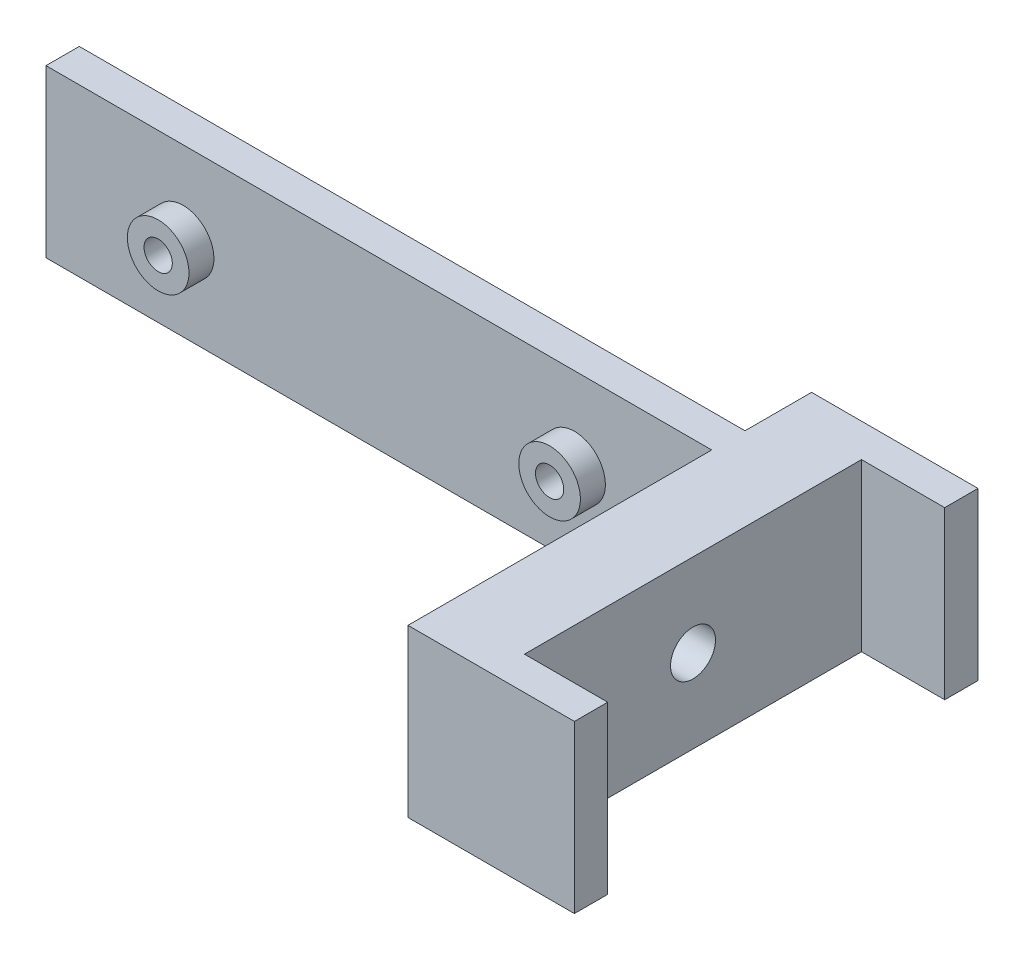
ISO-10303-21;
HEADER;
FILE_DESCRIPTION(('STEP AP214'),'2;1');
FILE_NAME('part.step','',(''),(''),'','','');
FILE_SCHEMA(('AUTOMOTIVE_DESIGN { 1 0 10303 214 1 1 1 1 }'));
ENDSEC;
DATA;
#1=APPLICATION_CONTEXT('core data for automotive mechanical design processes');
#2=APPLICATION_PROTOCOL_DEFINITION('international standard','automotive_design',2000,#1);
#3=PRODUCT_CONTEXT('',#1,'mechanical');
#4=PRODUCT('Part','Part','',(#3));
#5=PRODUCT_RELATED_PRODUCT_CATEGORY('part','',(#4));
#6=PRODUCT_DEFINITION_FORMATION('','',#4);
#7=PRODUCT_DEFINITION_CONTEXT('part definition',#1,'design');
#8=PRODUCT_DEFINITION('design','',#6,#7);
#9=PRODUCT_DEFINITION_SHAPE('','',#8);
#10=(LENGTH_UNIT() NAMED_UNIT(*) SI_UNIT(.MILLI.,.METRE.));
#11=(NAMED_UNIT(*) PLANE_ANGLE_UNIT() SI_UNIT($,.RADIAN.));
#12=(NAMED_UNIT(*) SI_UNIT($,.STERADIAN.) SOLID_ANGLE_UNIT());
#13=UNCERTAINTY_MEASURE_WITH_UNIT(LENGTH_MEASURE(1.E-05),#10,'distance_accuracy_value','');
#14=(GEOMETRIC_REPRESENTATION_CONTEXT(3) GLOBAL_UNCERTAINTY_ASSIGNED_CONTEXT((#13)) GLOBAL_UNIT_ASSIGNED_CONTEXT((#10,
#11,#12)) REPRESENTATION_CONTEXT('',''));
#15=CARTESIAN_POINT('',(0.,0.,0.));
#16=DIRECTION('',(0.,0.,1.));
#17=DIRECTION('',(1.,0.,0.));
#18=AXIS2_PLACEMENT_3D('',#15,#16,#17);
#19=CARTESIAN_POINT('',(63.52,10.,-8.001));
#20=DIRECTION('',(0.,0.,1.));
#21=DIRECTION('',(1.,0.,0.));
#22=AXIS2_PLACEMENT_3D('',#19,#20,#21);
#23=CYLINDRICAL_SURFACE('',#22,1.7);
#24=CARTESIAN_POINT('',(63.52,10.,7.));
#25=DIRECTION('',(0.,0.,1.));
#26=DIRECTION('',(1.,0.,0.));
#27=AXIS2_PLACEMENT_3D('',#24,#25,#26);
#28=CIRCLE('',#27,1.7);
#29=CARTESIAN_POINT('',(65.22,10.,7.));
#30=VERTEX_POINT('',#29);
#31=EDGE_CURVE('E307',#30,#30,#28,.T.);
#32=ORIENTED_EDGE('',*,*,#31,.T.);
#33=EDGE_LOOP('',(#32));
#34=FACE_BOUND('',#33,.T.);
#35=CARTESIAN_POINT('',(63.52,10.,3.));
#36=DIRECTION('',(0.,0.,-1.));
#37=DIRECTION('',(-1.,0.,0.));
#38=AXIS2_PLACEMENT_3D('',#35,#36,#37);
#39=CIRCLE('',#38,1.7);
#40=CARTESIAN_POINT('',(61.82,10.,3.));
#41=VERTEX_POINT('',#40);
#42=EDGE_CURVE('E39',#41,#41,#39,.F.);
#43=ORIENTED_EDGE('',*,*,#42,.F.);
#44=EDGE_LOOP('',(#43));
#45=FACE_BOUND('',#44,.T.);
#46=ADVANCED_FACE('F35',(#34,#45),#23,.F.);
#47=CARTESIAN_POINT('',(16.48,10.,-8.001));
#48=DIRECTION('',(0.,0.,1.));
#49=DIRECTION('',(1.,0.,0.));
#50=AXIS2_PLACEMENT_3D('',#47,#48,#49);
#51=CYLINDRICAL_SURFACE('',#50,1.7);
#52=CARTESIAN_POINT('',(16.48,10.,7.));
#53=DIRECTION('',(0.,0.,1.));
#54=DIRECTION('',(1.,0.,0.));
#55=AXIS2_PLACEMENT_3D('',#52,#53,#54);
#56=CIRCLE('',#55,1.7);
#57=CARTESIAN_POINT('',(18.18,10.,7.));
#58=VERTEX_POINT('',#57);
#59=EDGE_CURVE('E313',#58,#58,#56,.T.);
#60=ORIENTED_EDGE('',*,*,#59,.T.);
#61=EDGE_LOOP('',(#60));
#62=FACE_BOUND('',#61,.T.);
#63=CARTESIAN_POINT('',(16.48,10.,3.));
#64=DIRECTION('',(0.,0.,-1.));
#65=DIRECTION('',(-1.,0.,0.));
#66=AXIS2_PLACEMENT_3D('',#63,#64,#65);
#67=CIRCLE('',#66,1.7);
#68=CARTESIAN_POINT('',(14.78,10.,3.));
#69=VERTEX_POINT('',#68);
#70=EDGE_CURVE('E247',#69,#69,#67,.F.);
#71=ORIENTED_EDGE('',*,*,#70,.F.);
#72=EDGE_LOOP('',(#71));
#73=FACE_BOUND('',#72,.T.);
#74=ADVANCED_FACE('F420',(#62,#73),#51,.F.);
#75=CARTESIAN_POINT('',(-0.001000000000001,10.,16.25));
#76=DIRECTION('',(1.,0.,0.));
#77=DIRECTION('',(0.,0.,-1.));
#78=AXIS2_PLACEMENT_3D('',#75,#76,#77);
#79=CYLINDRICAL_SURFACE('',#78,2.7);
#80=CARTESIAN_POINT('',(90.,10.,16.25));
#81=DIRECTION('',(1.,0.,0.));
#82=DIRECTION('',(0.,0.,-1.));
#83=AXIS2_PLACEMENT_3D('',#80,#81,#82);
#84=CIRCLE('',#83,2.7);
#85=CARTESIAN_POINT('',(90.,10.,13.55));
#86=VERTEX_POINT('',#85);
#87=EDGE_CURVE('E319',#86,#86,#84,.T.);
#88=ORIENTED_EDGE('',*,*,#87,.T.);
#89=EDGE_LOOP('',(#88));
#90=FACE_BOUND('',#89,.T.);
#91=CARTESIAN_POINT('',(85.,10.,16.25));
#92=DIRECTION('',(-1.,0.,0.));
#93=DIRECTION('',(0.,0.,1.));
#94=AXIS2_PLACEMENT_3D('',#91,#92,#93);
#95=CIRCLE('',#94,2.7);
#96=CARTESIAN_POINT('',(85.,10.,18.95));
#97=VERTEX_POINT('',#96);
#98=EDGE_CURVE('E303',#97,#97,#95,.F.);
#99=ORIENTED_EDGE('',*,*,#98,.F.);
#100=EDGE_LOOP('',(#99));
#101=FACE_BOUND('',#100,.T.);
#102=ADVANCED_FACE('F426',(#90,#101),#79,.F.);
#103=CARTESIAN_POINT('',(0.,20.,4.));
#104=DIRECTION('',(0.,0.,-1.));
#105=DIRECTION('',(-1.,0.,0.));
#106=AXIS2_PLACEMENT_3D('',#103,#104,#105);
#107=PLANE('',#106);
#108=CARTESIAN_POINT('',(16.48,10.,4.));
#109=DIRECTION('',(0.,0.,-1.));
#110=DIRECTION('',(-1.,0.,0.));
#111=AXIS2_PLACEMENT_3D('',#108,#109,#110);
#112=CIRCLE('',#111,3.7);
#113=CARTESIAN_POINT('',(12.78,10.,4.));
#114=VERTEX_POINT('',#113);
#115=EDGE_CURVE('E44',#114,#114,#112,.F.);
#116=ORIENTED_EDGE('',*,*,#115,.F.);
#117=EDGE_LOOP('',(#116));
#118=FACE_BOUND('',#117,.T.);
#119=DIRECTION('',(1.,0.,0.));
#120=VECTOR('',#119,1.);
#121=CARTESIAN_POINT('',(0.,0.,4.));
#122=LINE('',#121,#120);
#123=CARTESIAN_POINT('',(0.,0.,4.));
#124=VERTEX_POINT('',#123);
#125=CARTESIAN_POINT('',(80.,0.,4.));
#126=VERTEX_POINT('',#125);
#127=EDGE_CURVE('E322',#124,#126,#122,.T.);
#128=ORIENTED_EDGE('',*,*,#127,.T.);
#129=DIRECTION('',(0.,-1.,0.));
#130=VECTOR('',#129,1.);
#131=CARTESIAN_POINT('',(80.,20.,4.));
#132=LINE('',#131,#130);
#133=CARTESIAN_POINT('',(80.,20.,4.));
#134=VERTEX_POINT('',#133);
#135=EDGE_CURVE('E407',#134,#126,#132,.T.);
#136=ORIENTED_EDGE('',*,*,#135,.F.);
#137=DIRECTION('',(1.,0.,0.));
#138=VECTOR('',#137,1.);
#139=CARTESIAN_POINT('',(0.,20.,4.));
#140=LINE('',#139,#138);
#141=CARTESIAN_POINT('',(0.,20.,4.));
#142=VERTEX_POINT('',#141);
#143=EDGE_CURVE('E323',#142,#134,#140,.T.);
#144=ORIENTED_EDGE('',*,*,#143,.F.);
#145=DIRECTION('',(0.,-1.,0.));
#146=VECTOR('',#145,1.);
#147=CARTESIAN_POINT('',(0.,20.,4.));
#148=LINE('',#147,#146);
#149=EDGE_CURVE('E353',#142,#124,#148,.T.);
#150=ORIENTED_EDGE('',*,*,#149,.T.);
#151=EDGE_LOOP('',(#128,#136,#144,#150));
#152=FACE_BOUND('',#151,.T.);
#153=CARTESIAN_POINT('',(63.52,10.,4.));
#154=DIRECTION('',(0.,0.,-1.));
#155=DIRECTION('',(-1.,0.,0.));
#156=AXIS2_PLACEMENT_3D('',#153,#154,#155);
#157=CIRCLE('',#156,3.70000000000001);
#158=CARTESIAN_POINT('',(59.82,10.,4.));
#159=VERTEX_POINT('',#158);
#160=EDGE_CURVE('E11',#159,#159,#157,.F.);
#161=ORIENTED_EDGE('',*,*,#160,.F.);
#162=EDGE_LOOP('',(#161));
#163=FACE_BOUND('',#162,.T.);
#164=ADVANCED_FACE('F37',(#118,#152,#163),#107,.F.);
#165=CARTESIAN_POINT('',(80.,20.,0.));
#166=DIRECTION('',(1.,0.,0.));
#167=DIRECTION('',(0.,0.,-1.));
#168=AXIS2_PLACEMENT_3D('',#165,#166,#167);
#169=PLANE('',#168);
#170=CARTESIAN_POINT('',(80.,10.,16.25));
#171=DIRECTION('',(-1.,0.,0.));
#172=DIRECTION('',(0.,0.,1.));
#173=AXIS2_PLACEMENT_3D('',#170,#171,#172);
#174=CIRCLE('',#173,4.3);
#175=CARTESIAN_POINT('',(80.,10.,20.55));
#176=VERTEX_POINT('',#175);
#177=EDGE_CURVE('E304',#176,#176,#174,.T.);
#178=ORIENTED_EDGE('',*,*,#177,.F.);
#179=EDGE_LOOP('',(#178));
#180=FACE_BOUND('',#179,.T.);
#181=DIRECTION('',(0.,0.,1.));
#182=VECTOR('',#181,1.);
#183=CARTESIAN_POINT('',(80.,0.,0.));
#184=LINE('',#183,#182);
#185=CARTESIAN_POINT('',(80.,0.,40.5));
#186=VERTEX_POINT('',#185);
#187=EDGE_CURVE('E356',#126,#186,#184,.T.);
#188=ORIENTED_EDGE('',*,*,#187,.T.);
#189=DIRECTION('',(0.,-1.,0.));
#190=VECTOR('',#189,1.);
#191=CARTESIAN_POINT('',(80.,20.,40.5));
#192=LINE('',#191,#190);
#193=CARTESIAN_POINT('',(80.,20.,40.5));
#194=VERTEX_POINT('',#193);
#195=EDGE_CURVE('E404',#194,#186,#192,.T.);
#196=ORIENTED_EDGE('',*,*,#195,.F.);
#197=DIRECTION('',(0.,0.,1.));
#198=VECTOR('',#197,1.);
#199=CARTESIAN_POINT('',(80.,20.,0.));
#200=LINE('',#199,#198);
#201=EDGE_CURVE('E326',#134,#194,#200,.T.);
#202=ORIENTED_EDGE('',*,*,#201,.F.);
#203=ORIENTED_EDGE('',*,*,#135,.T.);
#204=EDGE_LOOP('',(#188,#196,#202,#203));
#205=FACE_BOUND('',#204,.T.);
#206=ADVANCED_FACE('F456',(#180,#205),#169,.F.);
#207=CARTESIAN_POINT('',(0.,20.,40.5));
#208=DIRECTION('',(0.,0.,-1.));
#209=DIRECTION('',(-1.,0.,0.));
#210=AXIS2_PLACEMENT_3D('',#207,#208,#209);
#211=PLANE('',#210);
#212=DIRECTION('',(1.,0.,0.));
#213=VECTOR('',#212,1.);
#214=CARTESIAN_POINT('',(0.,0.,40.5));
#215=LINE('',#214,#213);
#216=CARTESIAN_POINT('',(100.,0.,40.5));
#217=VERTEX_POINT('',#216);
#218=EDGE_CURVE('E358',#186,#217,#215,.T.);
#219=ORIENTED_EDGE('',*,*,#218,.T.);
#220=DIRECTION('',(0.,-1.,0.));
#221=VECTOR('',#220,1.);
#222=CARTESIAN_POINT('',(100.,20.,40.5));
#223=LINE('',#222,#221);
#224=CARTESIAN_POINT('',(100.,20.,40.5));
#225=VERTEX_POINT('',#224);
#226=EDGE_CURVE('E401',#225,#217,#223,.T.);
#227=ORIENTED_EDGE('',*,*,#226,.F.);
#228=DIRECTION('',(1.,0.,0.));
#229=VECTOR('',#228,1.);
#230=CARTESIAN_POINT('',(0.,20.,40.5));
#231=LINE('',#230,#229);
#232=EDGE_CURVE('E329',#194,#225,#231,.T.);
#233=ORIENTED_EDGE('',*,*,#232,.F.);
#234=ORIENTED_EDGE('',*,*,#195,.T.);
#235=EDGE_LOOP('',(#219,#227,#233,#234));
#236=FACE_BOUND('',#235,.T.);
#237=ADVANCED_FACE('F478',(#236),#211,.F.);
#238=CARTESIAN_POINT('',(100.,20.,3.46944695195361E-13));
#239=DIRECTION('',(-1.,0.,0.));
#240=DIRECTION('',(0.,0.,1.));
#241=AXIS2_PLACEMENT_3D('',#238,#239,#240);
#242=PLANE('',#241);
#243=DIRECTION('',(0.,0.,-1.));
#244=VECTOR('',#243,1.);
#245=CARTESIAN_POINT('',(100.,0.,3.46944695195361E-13));
#246=LINE('',#245,#244);
#247=CARTESIAN_POINT('',(100.,0.,36.5));
#248=VERTEX_POINT('',#247);
#249=EDGE_CURVE('E361',#217,#248,#246,.T.);
#250=ORIENTED_EDGE('',*,*,#249,.T.);
#251=DIRECTION('',(0.,-1.,0.));
#252=VECTOR('',#251,1.);
#253=CARTESIAN_POINT('',(100.,20.,36.5));
#254=LINE('',#253,#252);
#255=CARTESIAN_POINT('',(100.,20.,36.5));
#256=VERTEX_POINT('',#255);
#257=EDGE_CURVE('E399',#256,#248,#254,.T.);
#258=ORIENTED_EDGE('',*,*,#257,.F.);
#259=DIRECTION('',(0.,0.,-1.));
#260=VECTOR('',#259,1.);
#261=CARTESIAN_POINT('',(100.,20.,3.46944695195361E-13));
#262=LINE('',#261,#260);
#263=EDGE_CURVE('E332',#225,#256,#262,.T.);
#264=ORIENTED_EDGE('',*,*,#263,.F.);
#265=ORIENTED_EDGE('',*,*,#226,.T.);
#266=EDGE_LOOP('',(#250,#258,#264,#265));
#267=FACE_BOUND('',#266,.T.);
#268=ADVANCED_FACE('F475',(#267),#242,.F.);
#269=CARTESIAN_POINT('',(0.,20.,36.5));
#270=DIRECTION('',(0.,0.,-1.));
#271=DIRECTION('',(-1.,0.,0.));
#272=AXIS2_PLACEMENT_3D('',#269,#270,#271);
#273=PLANE('',#272);
#274=DIRECTION('',(1.,0.,0.));
#275=VECTOR('',#274,1.);
#276=CARTESIAN_POINT('',(0.,0.,36.5));
#277=LINE('',#276,#275);
#278=CARTESIAN_POINT('',(90.,0.,36.5));
#279=VERTEX_POINT('',#278);
#280=EDGE_CURVE('E364',#279,#248,#277,.T.);
#281=ORIENTED_EDGE('',*,*,#280,.F.);
#282=DIRECTION('',(0.,-1.,0.));
#283=VECTOR('',#282,1.);
#284=CARTESIAN_POINT('',(90.,20.,36.5));
#285=LINE('',#284,#283);
#286=CARTESIAN_POINT('',(90.,20.,36.5));
#287=VERTEX_POINT('',#286);
#288=EDGE_CURVE('E397',#287,#279,#285,.T.);
#289=ORIENTED_EDGE('',*,*,#288,.F.);
#290=DIRECTION('',(1.,0.,0.));
#291=VECTOR('',#290,1.);
#292=CARTESIAN_POINT('',(0.,20.,36.5));
#293=LINE('',#292,#291);
#294=EDGE_CURVE('E334',#287,#256,#293,.T.);
#295=ORIENTED_EDGE('',*,*,#294,.T.);
#296=ORIENTED_EDGE('',*,*,#257,.T.);
#297=EDGE_LOOP('',(#281,#289,#295,#296));
#298=FACE_BOUND('',#297,.T.);
#299=ADVANCED_FACE('F471',(#298),#273,.T.);
#300=CARTESIAN_POINT('',(90.,20.,0.));
#301=DIRECTION('',(1.,0.,0.));
#302=DIRECTION('',(0.,0.,-1.));
#303=AXIS2_PLACEMENT_3D('',#300,#301,#302);
#304=PLANE('',#303);
#305=ORIENTED_EDGE('',*,*,#87,.F.);
#306=EDGE_LOOP('',(#305));
#307=FACE_BOUND('',#306,.T.);
#308=DIRECTION('',(0.,0.,1.));
#309=VECTOR('',#308,1.);
#310=CARTESIAN_POINT('',(90.,0.,0.));
#311=LINE('',#310,#309);
#312=CARTESIAN_POINT('',(90.,0.,-4.));
#313=VERTEX_POINT('',#312);
#314=EDGE_CURVE('E367',#313,#279,#311,.T.);
#315=ORIENTED_EDGE('',*,*,#314,.F.);
#316=DIRECTION('',(0.,-1.,0.));
#317=VECTOR('',#316,1.);
#318=CARTESIAN_POINT('',(90.,20.,-4.));
#319=LINE('',#318,#317);
#320=CARTESIAN_POINT('',(90.,20.,-4.));
#321=VERTEX_POINT('',#320);
#322=EDGE_CURVE('E395',#321,#313,#319,.T.);
#323=ORIENTED_EDGE('',*,*,#322,.F.);
#324=DIRECTION('',(0.,0.,1.));
#325=VECTOR('',#324,1.);
#326=CARTESIAN_POINT('',(90.,20.,0.));
#327=LINE('',#326,#325);
#328=EDGE_CURVE('E337',#321,#287,#327,.T.);
#329=ORIENTED_EDGE('',*,*,#328,.T.);
#330=ORIENTED_EDGE('',*,*,#288,.T.);
#331=EDGE_LOOP('',(#315,#323,#329,#330));
#332=FACE_BOUND('',#331,.T.);
#333=ADVANCED_FACE('F467',(#307,#332),#304,.T.);
#334=CARTESIAN_POINT('',(0.,20.,-3.99999999999999));
#335=DIRECTION('',(0.,0.,-1.));
#336=DIRECTION('',(-1.,0.,0.));
#337=AXIS2_PLACEMENT_3D('',#334,#335,#336);
#338=PLANE('',#337);
#339=DIRECTION('',(1.,0.,0.));
#340=VECTOR('',#339,1.);
#341=CARTESIAN_POINT('',(0.,0.,-3.99999999999999));
#342=LINE('',#341,#340);
#343=CARTESIAN_POINT('',(100.,0.,-4.));
#344=VERTEX_POINT('',#343);
#345=EDGE_CURVE('E370',#313,#344,#342,.T.);
#346=ORIENTED_EDGE('',*,*,#345,.T.);
#347=DIRECTION('',(0.,-1.,0.));
#348=VECTOR('',#347,1.);
#349=CARTESIAN_POINT('',(100.,20.,-4.));
#350=LINE('',#349,#348);
#351=CARTESIAN_POINT('',(100.,20.,-4.));
#352=VERTEX_POINT('',#351);
#353=EDGE_CURVE('E393',#352,#344,#350,.T.);
#354=ORIENTED_EDGE('',*,*,#353,.F.);
#355=DIRECTION('',(1.,0.,0.));
#356=VECTOR('',#355,1.);
#357=CARTESIAN_POINT('',(0.,20.,-3.99999999999999));
#358=LINE('',#357,#356);
#359=EDGE_CURVE('E340',#321,#352,#358,.T.);
#360=ORIENTED_EDGE('',*,*,#359,.F.);
#361=ORIENTED_EDGE('',*,*,#322,.T.);
#362=EDGE_LOOP('',(#346,#354,#360,#361));
#363=FACE_BOUND('',#362,.T.);
#364=ADVANCED_FACE('F463',(#363),#338,.F.);
#365=CARTESIAN_POINT('',(100.,20.,0.));
#366=DIRECTION('',(1.,0.,0.));
#367=DIRECTION('',(0.,0.,-1.));
#368=AXIS2_PLACEMENT_3D('',#365,#366,#367);
#369=PLANE('',#368);
#370=DIRECTION('',(0.,0.,1.));
#371=VECTOR('',#370,1.);
#372=CARTESIAN_POINT('',(100.,0.,0.));
#373=LINE('',#372,#371);
#374=CARTESIAN_POINT('',(100.,0.,-8.));
#375=VERTEX_POINT('',#374);
#376=EDGE_CURVE('E373',#375,#344,#373,.T.);
#377=ORIENTED_EDGE('',*,*,#376,.F.);
#378=DIRECTION('',(0.,-1.,0.));
#379=VECTOR('',#378,1.);
#380=CARTESIAN_POINT('',(100.,20.,-8.));
#381=LINE('',#380,#379);
#382=CARTESIAN_POINT('',(100.,20.,-8.));
#383=VERTEX_POINT('',#382);
#384=EDGE_CURVE('E391',#383,#375,#381,.T.);
#385=ORIENTED_EDGE('',*,*,#384,.F.);
#386=DIRECTION('',(0.,0.,1.));
#387=VECTOR('',#386,1.);
#388=CARTESIAN_POINT('',(100.,20.,0.));
#389=LINE('',#388,#387);
#390=EDGE_CURVE('E342',#383,#352,#389,.T.);
#391=ORIENTED_EDGE('',*,*,#390,.T.);
#392=ORIENTED_EDGE('',*,*,#353,.T.);
#393=EDGE_LOOP('',(#377,#385,#391,#392));
#394=FACE_BOUND('',#393,.T.);
#395=ADVANCED_FACE('F459',(#394),#369,.T.);
#396=CARTESIAN_POINT('',(0.,20.,-8.));
#397=DIRECTION('',(0.,0.,-1.));
#398=DIRECTION('',(-1.,0.,0.));
#399=AXIS2_PLACEMENT_3D('',#396,#397,#398);
#400=PLANE('',#399);
#401=DIRECTION('',(1.,0.,0.));
#402=VECTOR('',#401,1.);
#403=CARTESIAN_POINT('',(0.,0.,-8.));
#404=LINE('',#403,#402);
#405=CARTESIAN_POINT('',(80.,0.,-8.));
#406=VERTEX_POINT('',#405);
#407=EDGE_CURVE('E376',#406,#375,#404,.T.);
#408=ORIENTED_EDGE('',*,*,#407,.F.);
#409=DIRECTION('',(0.,-1.,0.));
#410=VECTOR('',#409,1.);
#411=CARTESIAN_POINT('',(80.,20.,-8.));
#412=LINE('',#411,#410);
#413=CARTESIAN_POINT('',(80.,20.,-8.));
#414=VERTEX_POINT('',#413);
#415=EDGE_CURVE('E389',#414,#406,#412,.T.);
#416=ORIENTED_EDGE('',*,*,#415,.F.);
#417=DIRECTION('',(1.,0.,0.));
#418=VECTOR('',#417,1.);
#419=CARTESIAN_POINT('',(0.,20.,-8.));
#420=LINE('',#419,#418);
#421=EDGE_CURVE('E345',#414,#383,#420,.T.);
#422=ORIENTED_EDGE('',*,*,#421,.T.);
#423=ORIENTED_EDGE('',*,*,#384,.T.);
#424=EDGE_LOOP('',(#408,#416,#422,#423));
#425=FACE_BOUND('',#424,.T.);
#426=ADVANCED_FACE('F454',(#425),#400,.T.);
#427=CARTESIAN_POINT('',(80.,0.,0.));
#428=VERTEX_POINT('',#427);
#429=EDGE_CURVE('E359',#406,#428,#184,.T.);
#430=ORIENTED_EDGE('',*,*,#429,.T.);
#431=DIRECTION('',(0.,-1.,0.));
#432=VECTOR('',#431,1.);
#433=CARTESIAN_POINT('',(80.,20.,0.));
#434=LINE('',#433,#432);
#435=CARTESIAN_POINT('',(80.,20.,0.));
#436=VERTEX_POINT('',#435);
#437=EDGE_CURVE('E387',#436,#428,#434,.T.);
#438=ORIENTED_EDGE('',*,*,#437,.F.);
#439=EDGE_CURVE('E330',#414,#436,#200,.T.);
#440=ORIENTED_EDGE('',*,*,#439,.F.);
#441=ORIENTED_EDGE('',*,*,#415,.T.);
#442=EDGE_LOOP('',(#430,#438,#440,#441));
#443=FACE_BOUND('',#442,.T.);
#444=ADVANCED_FACE('F450',(#443),#169,.F.);
#445=CARTESIAN_POINT('',(0.,20.,0.));
#446=DIRECTION('',(0.,0.,-1.));
#447=DIRECTION('',(-1.,0.,0.));
#448=AXIS2_PLACEMENT_3D('',#445,#446,#447);
#449=PLANE('',#448);
#450=DIRECTION('',(-0.866025403784439,0.5,0.));
#451=VECTOR('',#450,1.);
#452=CARTESIAN_POINT('',(63.52,6.82457351945706,0.));
#453=LINE('',#452,#451);
#454=CARTESIAN_POINT('',(63.52,6.82457351945706,0.));
#455=VERTEX_POINT('',#454);
#456=CARTESIAN_POINT('',(60.77,8.41228675972853,0.));
#457=VERTEX_POINT('',#456);
#458=EDGE_CURVE('E52',#455,#457,#453,.T.);
#459=ORIENTED_EDGE('',*,*,#458,.F.);
#460=DIRECTION('',(-0.866025403784438,-0.5,0.));
#461=VECTOR('',#460,1.);
#462=CARTESIAN_POINT('',(66.27,8.41228675972853,0.));
#463=LINE('',#462,#461);
#464=CARTESIAN_POINT('',(66.27,8.41228675972853,0.));
#465=VERTEX_POINT('',#464);
#466=EDGE_CURVE('E220',#465,#455,#463,.T.);
#467=ORIENTED_EDGE('',*,*,#466,.F.);
#468=DIRECTION('',(0.,-1.,0.));
#469=VECTOR('',#468,1.);
#470=CARTESIAN_POINT('',(66.27,11.5877132402715,0.));
#471=LINE('',#470,#469);
#472=CARTESIAN_POINT('',(66.27,11.5877132402715,0.));
#473=VERTEX_POINT('',#472);
#474=EDGE_CURVE('E223',#473,#465,#471,.T.);
#475=ORIENTED_EDGE('',*,*,#474,.F.);
#476=DIRECTION('',(0.866025403784438,-0.5,0.));
#477=VECTOR('',#476,1.);
#478=CARTESIAN_POINT('',(63.52,13.1754264805429,0.));
#479=LINE('',#478,#477);
#480=CARTESIAN_POINT('',(63.52,13.1754264805429,0.));
#481=VERTEX_POINT('',#480);
#482=EDGE_CURVE('E240',#481,#473,#479,.T.);
#483=ORIENTED_EDGE('',*,*,#482,.F.);
#484=DIRECTION('',(0.866025403784439,0.5,0.));
#485=VECTOR('',#484,1.);
#486=CARTESIAN_POINT('',(60.77,11.5877132402715,0.));
#487=LINE('',#486,#485);
#488=CARTESIAN_POINT('',(60.77,11.5877132402715,0.));
#489=VERTEX_POINT('',#488);
#490=EDGE_CURVE('E237',#489,#481,#487,.T.);
#491=ORIENTED_EDGE('',*,*,#490,.F.);
#492=DIRECTION('',(0.,1.,0.));
#493=VECTOR('',#492,1.);
#494=CARTESIAN_POINT('',(60.77,8.41228675972853,0.));
#495=LINE('',#494,#493);
#496=EDGE_CURVE('E234',#457,#489,#495,.T.);
#497=ORIENTED_EDGE('',*,*,#496,.F.);
#498=EDGE_LOOP('',(#459,#467,#475,#483,#491,#497));
#499=FACE_BOUND('',#498,.T.);
#500=DIRECTION('',(-0.866025403784438,0.5,0.));
#501=VECTOR('',#500,1.);
#502=CARTESIAN_POINT('',(16.48,6.82457351945705,0.));
#503=LINE('',#502,#501);
#504=CARTESIAN_POINT('',(16.48,6.82457351945705,0.));
#505=VERTEX_POINT('',#504);
#506=CARTESIAN_POINT('',(13.73,8.41228675972853,0.));
#507=VERTEX_POINT('',#506);
#508=EDGE_CURVE('E60',#505,#507,#503,.T.);
#509=ORIENTED_EDGE('',*,*,#508,.F.);
#510=DIRECTION('',(-0.866025403784439,-0.5,0.));
#511=VECTOR('',#510,1.);
#512=CARTESIAN_POINT('',(19.23,8.41228675972853,0.));
#513=LINE('',#512,#511);
#514=CARTESIAN_POINT('',(19.23,8.41228675972853,0.));
#515=VERTEX_POINT('',#514);
#516=EDGE_CURVE('E259',#515,#505,#513,.T.);
#517=ORIENTED_EDGE('',*,*,#516,.F.);
#518=DIRECTION('',(0.,-1.,0.));
#519=VECTOR('',#518,1.);
#520=CARTESIAN_POINT('',(19.23,11.5877132402715,0.));
#521=LINE('',#520,#519);
#522=CARTESIAN_POINT('',(19.23,11.5877132402715,0.));
#523=VERTEX_POINT('',#522);
#524=EDGE_CURVE('E285',#523,#515,#521,.T.);
#525=ORIENTED_EDGE('',*,*,#524,.F.);
#526=DIRECTION('',(0.866025403784438,-0.500000000000001,0.));
#527=VECTOR('',#526,1.);
#528=CARTESIAN_POINT('',(16.48,13.1754264805429,0.));
#529=LINE('',#528,#527);
#530=CARTESIAN_POINT('',(16.48,13.1754264805429,0.));
#531=VERTEX_POINT('',#530);
#532=EDGE_CURVE('E282',#531,#523,#529,.T.);
#533=ORIENTED_EDGE('',*,*,#532,.F.);
#534=DIRECTION('',(0.866025403784438,0.5,0.));
#535=VECTOR('',#534,1.);
#536=CARTESIAN_POINT('',(13.73,11.5877132402715,0.));
#537=LINE('',#536,#535);
#538=CARTESIAN_POINT('',(13.73,11.5877132402715,0.));
#539=VERTEX_POINT('',#538);
#540=EDGE_CURVE('E279',#539,#531,#537,.T.);
#541=ORIENTED_EDGE('',*,*,#540,.F.);
#542=DIRECTION('',(0.,1.,0.));
#543=VECTOR('',#542,1.);
#544=CARTESIAN_POINT('',(13.73,8.41228675972853,0.));
#545=LINE('',#544,#543);
#546=EDGE_CURVE('E276',#507,#539,#545,.T.);
#547=ORIENTED_EDGE('',*,*,#546,.F.);
#548=EDGE_LOOP('',(#509,#517,#525,#533,#541,#547));
#549=FACE_BOUND('',#548,.T.);
#550=DIRECTION('',(1.,0.,0.));
#551=VECTOR('',#550,1.);
#552=CARTESIAN_POINT('',(0.,0.,0.));
#553=LINE('',#552,#551);
#554=CARTESIAN_POINT('',(0.,0.,0.));
#555=VERTEX_POINT('',#554);
#556=EDGE_CURVE('E379',#555,#428,#553,.T.);
#557=ORIENTED_EDGE('',*,*,#556,.F.);
#558=DIRECTION('',(0.,-1.,0.));
#559=VECTOR('',#558,1.);
#560=CARTESIAN_POINT('',(0.,20.,0.));
#561=LINE('',#560,#559);
#562=CARTESIAN_POINT('',(0.,20.,0.));
#563=VERTEX_POINT('',#562);
#564=EDGE_CURVE('E385',#563,#555,#561,.T.);
#565=ORIENTED_EDGE('',*,*,#564,.F.);
#566=DIRECTION('',(1.,0.,0.));
#567=VECTOR('',#566,1.);
#568=CARTESIAN_POINT('',(0.,20.,0.));
#569=LINE('',#568,#567);
#570=EDGE_CURVE('E348',#563,#436,#569,.T.);
#571=ORIENTED_EDGE('',*,*,#570,.T.);
#572=ORIENTED_EDGE('',*,*,#437,.T.);
#573=EDGE_LOOP('',(#557,#565,#571,#572));
#574=FACE_BOUND('',#573,.T.);
#575=ADVANCED_FACE('F446',(#499,#549,#574),#449,.T.);
#576=CARTESIAN_POINT('',(0.,20.,0.));
#577=DIRECTION('',(1.,0.,0.));
#578=DIRECTION('',(0.,0.,-1.));
#579=AXIS2_PLACEMENT_3D('',#576,#577,#578);
#580=PLANE('',#579);
#581=DIRECTION('',(0.,0.,1.));
#582=VECTOR('',#581,1.);
#583=CARTESIAN_POINT('',(0.,0.,0.));
#584=LINE('',#583,#582);
#585=EDGE_CURVE('E327',#555,#124,#584,.T.);
#586=ORIENTED_EDGE('',*,*,#585,.T.);
#587=ORIENTED_EDGE('',*,*,#149,.F.);
#588=DIRECTION('',(0.,0.,1.));
#589=VECTOR('',#588,1.);
#590=CARTESIAN_POINT('',(0.,20.,0.));
#591=LINE('',#590,#589);
#592=EDGE_CURVE('E351',#563,#142,#591,.T.);
#593=ORIENTED_EDGE('',*,*,#592,.F.);
#594=ORIENTED_EDGE('',*,*,#564,.T.);
#595=EDGE_LOOP('',(#586,#587,#593,#594));
#596=FACE_BOUND('',#595,.T.);
#597=ADVANCED_FACE('F438',(#596),#580,.F.);
#598=CARTESIAN_POINT('',(0.,20.,0.));
#599=DIRECTION('',(0.,1.,0.));
#600=DIRECTION('',(0.,0.,1.));
#601=AXIS2_PLACEMENT_3D('',#598,#599,#600);
#602=PLANE('',#601);
#603=ORIENTED_EDGE('',*,*,#143,.T.);
#604=ORIENTED_EDGE('',*,*,#201,.T.);
#605=ORIENTED_EDGE('',*,*,#232,.T.);
#606=ORIENTED_EDGE('',*,*,#263,.T.);
#607=ORIENTED_EDGE('',*,*,#294,.F.);
#608=ORIENTED_EDGE('',*,*,#328,.F.);
#609=ORIENTED_EDGE('',*,*,#359,.T.);
#610=ORIENTED_EDGE('',*,*,#390,.F.);
#611=ORIENTED_EDGE('',*,*,#421,.F.);
#612=ORIENTED_EDGE('',*,*,#439,.T.);
#613=ORIENTED_EDGE('',*,*,#570,.F.);
#614=ORIENTED_EDGE('',*,*,#592,.T.);
#615=EDGE_LOOP('',(#603,#604,#605,#606,#607,#608,#609,#610,#611,#612,#613,#614));
#616=FACE_BOUND('',#615,.T.);
#617=ADVANCED_FACE('F434',(#616),#602,.T.);
#618=CARTESIAN_POINT('',(0.,0.,0.));
#619=DIRECTION('',(0.,1.,0.));
#620=DIRECTION('',(0.,0.,1.));
#621=AXIS2_PLACEMENT_3D('',#618,#619,#620);
#622=PLANE('',#621);
#623=ORIENTED_EDGE('',*,*,#127,.F.);
#624=ORIENTED_EDGE('',*,*,#585,.F.);
#625=ORIENTED_EDGE('',*,*,#556,.T.);
#626=ORIENTED_EDGE('',*,*,#429,.F.);
#627=ORIENTED_EDGE('',*,*,#407,.T.);
#628=ORIENTED_EDGE('',*,*,#376,.T.);
#629=ORIENTED_EDGE('',*,*,#345,.F.);
#630=ORIENTED_EDGE('',*,*,#314,.T.);
#631=ORIENTED_EDGE('',*,*,#280,.T.);
#632=ORIENTED_EDGE('',*,*,#249,.F.);
#633=ORIENTED_EDGE('',*,*,#218,.F.);
#634=ORIENTED_EDGE('',*,*,#187,.F.);
#635=EDGE_LOOP('',(#623,#624,#625,#626,#627,#628,#629,#630,#631,#632,#633,#634));
#636=FACE_BOUND('',#635,.T.);
#637=ADVANCED_FACE('F437',(#636),#622,.F.);
#638=CARTESIAN_POINT('',(16.48,10.,7.));
#639=DIRECTION('',(0.,0.,1.));
#640=DIRECTION('',(1.,0.,0.));
#641=AXIS2_PLACEMENT_3D('',#638,#639,#640);
#642=PLANE('',#641);
#643=CARTESIAN_POINT('',(16.48,10.,7.));
#644=DIRECTION('',(0.,0.,1.));
#645=DIRECTION('',(1.,0.,0.));
#646=AXIS2_PLACEMENT_3D('',#643,#644,#645);
#647=CIRCLE('',#646,3.7);
#648=CARTESIAN_POINT('',(20.18,10.,7.));
#649=VERTEX_POINT('',#648);
#650=EDGE_CURVE('E316',#649,#649,#647,.T.);
#651=ORIENTED_EDGE('',*,*,#650,.T.);
#652=EDGE_LOOP('',(#651));
#653=FACE_BOUND('',#652,.T.);
#654=ORIENTED_EDGE('',*,*,#59,.F.);
#655=EDGE_LOOP('',(#654));
#656=FACE_BOUND('',#655,.T.);
#657=ADVANCED_FACE('F442',(#653,#656),#642,.T.);
#658=CARTESIAN_POINT('',(16.48,10.,7.));
#659=DIRECTION('',(0.,0.,-1.));
#660=DIRECTION('',(-1.,0.,0.));
#661=AXIS2_PLACEMENT_3D('',#658,#659,#660);
#662=CYLINDRICAL_SURFACE('',#661,3.7);
#663=ORIENTED_EDGE('',*,*,#650,.F.);
#664=EDGE_LOOP('',(#663));
#665=FACE_BOUND('',#664,.T.);
#666=ORIENTED_EDGE('',*,*,#115,.T.);
#667=EDGE_LOOP('',(#666));
#668=FACE_BOUND('',#667,.T.);
#669=ADVANCED_FACE('F538',(#665,#668),#662,.T.);
#670=CARTESIAN_POINT('',(63.52,10.,7.));
#671=DIRECTION('',(0.,0.,1.));
#672=DIRECTION('',(1.,0.,0.));
#673=AXIS2_PLACEMENT_3D('',#670,#671,#672);
#674=PLANE('',#673);
#675=CARTESIAN_POINT('',(63.52,10.,7.));
#676=DIRECTION('',(0.,0.,1.));
#677=DIRECTION('',(1.,0.,0.));
#678=AXIS2_PLACEMENT_3D('',#675,#676,#677);
#679=CIRCLE('',#678,3.70000000000001);
#680=CARTESIAN_POINT('',(67.22,10.,7.));
#681=VERTEX_POINT('',#680);
#682=EDGE_CURVE('E310',#681,#681,#679,.T.);
#683=ORIENTED_EDGE('',*,*,#682,.T.);
#684=EDGE_LOOP('',(#683));
#685=FACE_BOUND('',#684,.T.);
#686=ORIENTED_EDGE('',*,*,#31,.F.);
#687=EDGE_LOOP('',(#686));
#688=FACE_BOUND('',#687,.T.);
#689=ADVANCED_FACE('F528',(#685,#688),#674,.T.);
#690=CARTESIAN_POINT('',(63.52,10.,7.));
#691=DIRECTION('',(0.,0.,-1.));
#692=DIRECTION('',(-1.,0.,0.));
#693=AXIS2_PLACEMENT_3D('',#690,#691,#692);
#694=CYLINDRICAL_SURFACE('',#693,3.70000000000001);
#695=ORIENTED_EDGE('',*,*,#682,.F.);
#696=EDGE_LOOP('',(#695));
#697=FACE_BOUND('',#696,.T.);
#698=ORIENTED_EDGE('',*,*,#160,.T.);
#699=EDGE_LOOP('',(#698));
#700=FACE_BOUND('',#699,.T.);
#701=ADVANCED_FACE('F525',(#697,#700),#694,.T.);
#702=CARTESIAN_POINT('',(85.,10.,16.25));
#703=DIRECTION('',(-1.,0.,0.));
#704=DIRECTION('',(0.,0.,1.));
#705=AXIS2_PLACEMENT_3D('',#702,#703,#704);
#706=PLANE('',#705);
#707=CARTESIAN_POINT('',(85.,10.,16.25));
#708=DIRECTION('',(-1.,0.,0.));
#709=DIRECTION('',(0.,0.,1.));
#710=AXIS2_PLACEMENT_3D('',#707,#708,#709);
#711=CIRCLE('',#710,4.3);
#712=CARTESIAN_POINT('',(85.,10.,20.55));
#713=VERTEX_POINT('',#712);
#714=EDGE_CURVE('E300',#713,#713,#711,.T.);
#715=ORIENTED_EDGE('',*,*,#714,.T.);
#716=EDGE_LOOP('',(#715));
#717=FACE_BOUND('',#716,.T.);
#718=ORIENTED_EDGE('',*,*,#98,.T.);
#719=EDGE_LOOP('',(#718));
#720=FACE_BOUND('',#719,.T.);
#721=ADVANCED_FACE('F527',(#717,#720),#706,.T.);
#722=CARTESIAN_POINT('',(85.,10.,16.25));
#723=DIRECTION('',(-1.,0.,0.));
#724=DIRECTION('',(0.,0.,1.));
#725=AXIS2_PLACEMENT_3D('',#722,#723,#724);
#726=CYLINDRICAL_SURFACE('',#725,4.3);
#727=ORIENTED_EDGE('',*,*,#714,.F.);
#728=EDGE_LOOP('',(#727));
#729=FACE_BOUND('',#728,.T.);
#730=ORIENTED_EDGE('',*,*,#177,.T.);
#731=EDGE_LOOP('',(#730));
#732=FACE_BOUND('',#731,.T.);
#733=ADVANCED_FACE('F535',(#729,#732),#726,.F.);
#734=CARTESIAN_POINT('',(0.,0.,3.));
#735=DIRECTION('',(0.,0.,-1.));
#736=DIRECTION('',(-1.,0.,0.));
#737=AXIS2_PLACEMENT_3D('',#734,#735,#736);
#738=PLANE('',#737);
#739=DIRECTION('',(-0.866025403784438,0.5,0.));
#740=VECTOR('',#739,1.);
#741=CARTESIAN_POINT('',(16.48,6.82457351945705,3.));
#742=LINE('',#741,#740);
#743=CARTESIAN_POINT('',(16.48,6.82457351945705,3.));
#744=VERTEX_POINT('',#743);
#745=CARTESIAN_POINT('',(13.73,8.41228675972853,3.));
#746=VERTEX_POINT('',#745);
#747=EDGE_CURVE('E255',#744,#746,#742,.T.);
#748=ORIENTED_EDGE('',*,*,#747,.T.);
#749=DIRECTION('',(0.,1.,0.));
#750=VECTOR('',#749,1.);
#751=CARTESIAN_POINT('',(13.73,8.41228675972853,3.));
#752=LINE('',#751,#750);
#753=CARTESIAN_POINT('',(13.73,11.5877132402715,3.));
#754=VERTEX_POINT('',#753);
#755=EDGE_CURVE('E258',#746,#754,#752,.T.);
#756=ORIENTED_EDGE('',*,*,#755,.T.);
#757=DIRECTION('',(0.866025403784438,0.5,0.));
#758=VECTOR('',#757,1.);
#759=CARTESIAN_POINT('',(13.73,11.5877132402715,3.));
#760=LINE('',#759,#758);
#761=CARTESIAN_POINT('',(16.48,13.1754264805429,3.));
#762=VERTEX_POINT('',#761);
#763=EDGE_CURVE('E262',#754,#762,#760,.T.);
#764=ORIENTED_EDGE('',*,*,#763,.T.);
#765=DIRECTION('',(0.866025403784438,-0.500000000000001,0.));
#766=VECTOR('',#765,1.);
#767=CARTESIAN_POINT('',(16.48,13.1754264805429,3.));
#768=LINE('',#767,#766);
#769=CARTESIAN_POINT('',(19.23,11.5877132402715,3.));
#770=VERTEX_POINT('',#769);
#771=EDGE_CURVE('E265',#762,#770,#768,.T.);
#772=ORIENTED_EDGE('',*,*,#771,.T.);
#773=DIRECTION('',(0.,-1.,0.));
#774=VECTOR('',#773,1.);
#775=CARTESIAN_POINT('',(19.23,11.5877132402715,3.));
#776=LINE('',#775,#774);
#777=CARTESIAN_POINT('',(19.23,8.41228675972853,3.));
#778=VERTEX_POINT('',#777);
#779=EDGE_CURVE('E268',#770,#778,#776,.T.);
#780=ORIENTED_EDGE('',*,*,#779,.T.);
#781=DIRECTION('',(-0.866025403784439,-0.5,0.));
#782=VECTOR('',#781,1.);
#783=CARTESIAN_POINT('',(19.23,8.41228675972853,3.));
#784=LINE('',#783,#782);
#785=EDGE_CURVE('E271',#778,#744,#784,.T.);
#786=ORIENTED_EDGE('',*,*,#785,.T.);
#787=EDGE_LOOP('',(#748,#756,#764,#772,#780,#786));
#788=FACE_BOUND('',#787,.T.);
#789=ORIENTED_EDGE('',*,*,#70,.T.);
#790=EDGE_LOOP('',(#789));
#791=FACE_BOUND('',#790,.T.);
#792=ADVANCED_FACE('F594',(#788,#791),#738,.T.);
#793=CARTESIAN_POINT('',(16.48,6.82457351945705,3.));
#794=DIRECTION('',(-0.5,-0.866025403784439,0.));
#795=DIRECTION('',(0.866025403784439,-0.5,0.));
#796=AXIS2_PLACEMENT_3D('',#793,#794,#795);
#797=PLANE('',#796);
#798=ORIENTED_EDGE('',*,*,#508,.T.);
#799=DIRECTION('',(0.,0.,-1.));
#800=VECTOR('',#799,1.);
#801=CARTESIAN_POINT('',(13.73,8.41228675972853,3.));
#802=LINE('',#801,#800);
#803=EDGE_CURVE('E274',#746,#507,#802,.T.);
#804=ORIENTED_EDGE('',*,*,#803,.F.);
#805=ORIENTED_EDGE('',*,*,#747,.F.);
#806=DIRECTION('',(0.,0.,-1.));
#807=VECTOR('',#806,1.);
#808=CARTESIAN_POINT('',(16.48,6.82457351945705,3.));
#809=LINE('',#808,#807);
#810=EDGE_CURVE('E235',#744,#505,#809,.T.);
#811=ORIENTED_EDGE('',*,*,#810,.T.);
#812=EDGE_LOOP('',(#798,#804,#805,#811));
#813=FACE_BOUND('',#812,.T.);
#814=ADVANCED_FACE('F624',(#813),#797,.F.);
#815=CARTESIAN_POINT('',(19.23,8.41228675972853,3.));
#816=DIRECTION('',(0.5,-0.866025403784439,0.));
#817=DIRECTION('',(0.866025403784439,0.5,0.));
#818=AXIS2_PLACEMENT_3D('',#815,#816,#817);
#819=PLANE('',#818);
#820=ORIENTED_EDGE('',*,*,#516,.T.);
#821=ORIENTED_EDGE('',*,*,#810,.F.);
#822=ORIENTED_EDGE('',*,*,#785,.F.);
#823=DIRECTION('',(0.,0.,-1.));
#824=VECTOR('',#823,1.);
#825=CARTESIAN_POINT('',(19.23,8.41228675972853,3.));
#826=LINE('',#825,#824);
#827=EDGE_CURVE('E291',#778,#515,#826,.T.);
#828=ORIENTED_EDGE('',*,*,#827,.T.);
#829=EDGE_LOOP('',(#820,#821,#822,#828));
#830=FACE_BOUND('',#829,.T.);
#831=ADVANCED_FACE('F634',(#830),#819,.F.);
#832=CARTESIAN_POINT('',(19.23,11.5877132402715,3.));
#833=DIRECTION('',(1.,0.,0.));
#834=DIRECTION('',(0.,1.,0.));
#835=AXIS2_PLACEMENT_3D('',#832,#833,#834);
#836=PLANE('',#835);
#837=ORIENTED_EDGE('',*,*,#524,.T.);
#838=ORIENTED_EDGE('',*,*,#827,.F.);
#839=ORIENTED_EDGE('',*,*,#779,.F.);
#840=DIRECTION('',(0.,0.,-1.));
#841=VECTOR('',#840,1.);
#842=CARTESIAN_POINT('',(19.23,11.5877132402715,3.));
#843=LINE('',#842,#841);
#844=EDGE_CURVE('E293',#770,#523,#843,.T.);
#845=ORIENTED_EDGE('',*,*,#844,.T.);
#846=EDGE_LOOP('',(#837,#838,#839,#845));
#847=FACE_BOUND('',#846,.T.);
#848=ADVANCED_FACE('F643',(#847),#836,.F.);
#849=CARTESIAN_POINT('',(16.48,13.1754264805429,3.));
#850=DIRECTION('',(0.500000000000001,0.866025403784438,0.));
#851=DIRECTION('',(-0.866025403784438,0.500000000000001,0.));
#852=AXIS2_PLACEMENT_3D('',#849,#850,#851);
#853=PLANE('',#852);
#854=ORIENTED_EDGE('',*,*,#532,.T.);
#855=ORIENTED_EDGE('',*,*,#844,.F.);
#856=ORIENTED_EDGE('',*,*,#771,.F.);
#857=DIRECTION('',(0.,0.,-1.));
#858=VECTOR('',#857,1.);
#859=CARTESIAN_POINT('',(16.48,13.1754264805429,3.));
#860=LINE('',#859,#858);
#861=EDGE_CURVE('E295',#762,#531,#860,.T.);
#862=ORIENTED_EDGE('',*,*,#861,.T.);
#863=EDGE_LOOP('',(#854,#855,#856,#862));
#864=FACE_BOUND('',#863,.T.);
#865=ADVANCED_FACE('F653',(#864),#853,.F.);
#866=CARTESIAN_POINT('',(13.73,11.5877132402715,3.));
#867=DIRECTION('',(-0.5,0.866025403784439,0.));
#868=DIRECTION('',(-0.866025403784439,-0.5,0.));
#869=AXIS2_PLACEMENT_3D('',#866,#867,#868);
#870=PLANE('',#869);
#871=ORIENTED_EDGE('',*,*,#540,.T.);
#872=ORIENTED_EDGE('',*,*,#861,.F.);
#873=ORIENTED_EDGE('',*,*,#763,.F.);
#874=DIRECTION('',(0.,0.,-1.));
#875=VECTOR('',#874,1.);
#876=CARTESIAN_POINT('',(13.73,11.5877132402715,3.));
#877=LINE('',#876,#875);
#878=EDGE_CURVE('E297',#754,#539,#877,.T.);
#879=ORIENTED_EDGE('',*,*,#878,.T.);
#880=EDGE_LOOP('',(#871,#872,#873,#879));
#881=FACE_BOUND('',#880,.T.);
#882=ADVANCED_FACE('F663',(#881),#870,.F.);
#883=CARTESIAN_POINT('',(13.73,8.41228675972853,3.));
#884=DIRECTION('',(-1.,0.,0.));
#885=DIRECTION('',(0.,0.,1.));
#886=AXIS2_PLACEMENT_3D('',#883,#884,#885);
#887=PLANE('',#886);
#888=ORIENTED_EDGE('',*,*,#546,.T.);
#889=ORIENTED_EDGE('',*,*,#878,.F.);
#890=ORIENTED_EDGE('',*,*,#755,.F.);
#891=ORIENTED_EDGE('',*,*,#803,.T.);
#892=EDGE_LOOP('',(#888,#889,#890,#891));
#893=FACE_BOUND('',#892,.T.);
#894=ADVANCED_FACE('F673',(#893),#887,.F.);
#895=CARTESIAN_POINT('',(0.,0.,3.));
#896=DIRECTION('',(0.,0.,-1.));
#897=DIRECTION('',(-1.,0.,0.));
#898=AXIS2_PLACEMENT_3D('',#895,#896,#897);
#899=PLANE('',#898);
#900=DIRECTION('',(-0.866025403784439,0.5,0.));
#901=VECTOR('',#900,1.);
#902=CARTESIAN_POINT('',(63.52,6.82457351945706,3.));
#903=LINE('',#902,#901);
#904=CARTESIAN_POINT('',(63.52,6.82457351945706,3.));
#905=VERTEX_POINT('',#904);
#906=CARTESIAN_POINT('',(60.77,8.41228675972853,3.));
#907=VERTEX_POINT('',#906);
#908=EDGE_CURVE('E200',#905,#907,#903,.T.);
#909=ORIENTED_EDGE('',*,*,#908,.T.);
#910=DIRECTION('',(0.,1.,0.));
#911=VECTOR('',#910,1.);
#912=CARTESIAN_POINT('',(60.77,8.41228675972853,3.));
#913=LINE('',#912,#911);
#914=CARTESIAN_POINT('',(60.77,11.5877132402715,3.));
#915=VERTEX_POINT('',#914);
#916=EDGE_CURVE('E209',#907,#915,#913,.T.);
#917=ORIENTED_EDGE('',*,*,#916,.T.);
#918=DIRECTION('',(0.866025403784439,0.5,0.));
#919=VECTOR('',#918,1.);
#920=CARTESIAN_POINT('',(60.77,11.5877132402715,3.));
#921=LINE('',#920,#919);
#922=CARTESIAN_POINT('',(63.52,13.1754264805429,3.));
#923=VERTEX_POINT('',#922);
#924=EDGE_CURVE('E214',#915,#923,#921,.T.);
#925=ORIENTED_EDGE('',*,*,#924,.T.);
#926=DIRECTION('',(0.866025403784438,-0.5,0.));
#927=VECTOR('',#926,1.);
#928=CARTESIAN_POINT('',(63.52,13.1754264805429,3.));
#929=LINE('',#928,#927);
#930=CARTESIAN_POINT('',(66.27,11.5877132402715,3.));
#931=VERTEX_POINT('',#930);
#932=EDGE_CURVE('E227',#923,#931,#929,.T.);
#933=ORIENTED_EDGE('',*,*,#932,.T.);
#934=DIRECTION('',(0.,-1.,0.));
#935=VECTOR('',#934,1.);
#936=CARTESIAN_POINT('',(66.27,11.5877132402715,3.));
#937=LINE('',#936,#935);
#938=CARTESIAN_POINT('',(66.27,8.41228675972853,3.));
#939=VERTEX_POINT('',#938);
#940=EDGE_CURVE('E230',#931,#939,#937,.T.);
#941=ORIENTED_EDGE('',*,*,#940,.T.);
#942=DIRECTION('',(-0.866025403784438,-0.5,0.));
#943=VECTOR('',#942,1.);
#944=CARTESIAN_POINT('',(66.27,8.41228675972853,3.));
#945=LINE('',#944,#943);
#946=EDGE_CURVE('E206',#939,#905,#945,.T.);
#947=ORIENTED_EDGE('',*,*,#946,.T.);
#948=EDGE_LOOP('',(#909,#917,#925,#933,#941,#947));
#949=FACE_BOUND('',#948,.T.);
#950=ORIENTED_EDGE('',*,*,#42,.T.);
#951=EDGE_LOOP('',(#950));
#952=FACE_BOUND('',#951,.T.);
#953=ADVANCED_FACE('F216',(#949,#952),#899,.T.);
#954=CARTESIAN_POINT('',(63.52,6.82457351945706,3.));
#955=DIRECTION('',(-0.5,-0.866025403784439,0.));
#956=DIRECTION('',(0.866025403784439,-0.5,0.));
#957=AXIS2_PLACEMENT_3D('',#954,#955,#956);
#958=PLANE('',#957);
#959=ORIENTED_EDGE('',*,*,#458,.T.);
#960=DIRECTION('',(0.,0.,-1.));
#961=VECTOR('',#960,1.);
#962=CARTESIAN_POINT('',(60.77,8.41228675972853,3.));
#963=LINE('',#962,#961);
#964=EDGE_CURVE('E196',#907,#457,#963,.T.);
#965=ORIENTED_EDGE('',*,*,#964,.F.);
#966=ORIENTED_EDGE('',*,*,#908,.F.);
#967=DIRECTION('',(0.,0.,-1.));
#968=VECTOR('',#967,1.);
#969=CARTESIAN_POINT('',(63.52,6.82457351945706,3.));
#970=LINE('',#969,#968);
#971=EDGE_CURVE('E245',#905,#455,#970,.T.);
#972=ORIENTED_EDGE('',*,*,#971,.T.);
#973=EDGE_LOOP('',(#959,#965,#966,#972));
#974=FACE_BOUND('',#973,.T.);
#975=ADVANCED_FACE('F198',(#974),#958,.F.);
#976=CARTESIAN_POINT('',(66.27,8.41228675972853,3.));
#977=DIRECTION('',(0.5,-0.866025403784438,0.));
#978=DIRECTION('',(0.866025403784438,0.5,0.));
#979=AXIS2_PLACEMENT_3D('',#976,#977,#978);
#980=PLANE('',#979);
#981=ORIENTED_EDGE('',*,*,#466,.T.);
#982=ORIENTED_EDGE('',*,*,#971,.F.);
#983=ORIENTED_EDGE('',*,*,#946,.F.);
#984=DIRECTION('',(0.,0.,-1.));
#985=VECTOR('',#984,1.);
#986=CARTESIAN_POINT('',(66.27,8.41228675972853,3.));
#987=LINE('',#986,#985);
#988=EDGE_CURVE('E248',#939,#465,#987,.T.);
#989=ORIENTED_EDGE('',*,*,#988,.T.);
#990=EDGE_LOOP('',(#981,#982,#983,#989));
#991=FACE_BOUND('',#990,.T.);
#992=ADVANCED_FACE('F700',(#991),#980,.F.);
#993=CARTESIAN_POINT('',(66.27,11.5877132402715,3.));
#994=DIRECTION('',(1.,0.,0.));
#995=DIRECTION('',(0.,0.,-1.));
#996=AXIS2_PLACEMENT_3D('',#993,#994,#995);
#997=PLANE('',#996);
#998=ORIENTED_EDGE('',*,*,#474,.T.);
#999=ORIENTED_EDGE('',*,*,#988,.F.);
#1000=ORIENTED_EDGE('',*,*,#940,.F.);
#1001=DIRECTION('',(0.,0.,-1.));
#1002=VECTOR('',#1001,1.);
#1003=CARTESIAN_POINT('',(66.27,11.5877132402715,3.));
#1004=LINE('',#1003,#1002);
#1005=EDGE_CURVE('E250',#931,#473,#1004,.T.);
#1006=ORIENTED_EDGE('',*,*,#1005,.T.);
#1007=EDGE_LOOP('',(#998,#999,#1000,#1006));
#1008=FACE_BOUND('',#1007,.T.);
#1009=ADVANCED_FACE('F709',(#1008),#997,.F.);
#1010=CARTESIAN_POINT('',(63.52,13.1754264805429,3.));
#1011=DIRECTION('',(0.5,0.866025403784438,0.));
#1012=DIRECTION('',(-0.866025403784438,0.5,0.));
#1013=AXIS2_PLACEMENT_3D('',#1010,#1011,#1012);
#1014=PLANE('',#1013);
#1015=ORIENTED_EDGE('',*,*,#482,.T.);
#1016=ORIENTED_EDGE('',*,*,#1005,.F.);
#1017=ORIENTED_EDGE('',*,*,#932,.F.);
#1018=DIRECTION('',(0.,0.,-1.));
#1019=VECTOR('',#1018,1.);
#1020=CARTESIAN_POINT('',(63.52,13.1754264805429,3.));
#1021=LINE('',#1020,#1019);
#1022=EDGE_CURVE('E252',#923,#481,#1021,.T.);
#1023=ORIENTED_EDGE('',*,*,#1022,.T.);
#1024=EDGE_LOOP('',(#1015,#1016,#1017,#1023));
#1025=FACE_BOUND('',#1024,.T.);
#1026=ADVANCED_FACE('F719',(#1025),#1014,.F.);
#1027=CARTESIAN_POINT('',(60.77,11.5877132402715,3.));
#1028=DIRECTION('',(-0.5,0.866025403784439,0.));
#1029=DIRECTION('',(-0.866025403784439,-0.5,0.));
#1030=AXIS2_PLACEMENT_3D('',#1027,#1028,#1029);
#1031=PLANE('',#1030);
#1032=ORIENTED_EDGE('',*,*,#490,.T.);
#1033=ORIENTED_EDGE('',*,*,#1022,.F.);
#1034=ORIENTED_EDGE('',*,*,#924,.F.);
#1035=DIRECTION('',(0.,0.,-1.));
#1036=VECTOR('',#1035,1.);
#1037=CARTESIAN_POINT('',(60.77,11.5877132402715,3.));
#1038=LINE('',#1037,#1036);
#1039=EDGE_CURVE('E205',#915,#489,#1038,.T.);
#1040=ORIENTED_EDGE('',*,*,#1039,.T.);
#1041=EDGE_LOOP('',(#1032,#1033,#1034,#1040));
#1042=FACE_BOUND('',#1041,.T.);
#1043=ADVANCED_FACE('F729',(#1042),#1031,.F.);
#1044=CARTESIAN_POINT('',(60.77,8.41228675972853,3.));
#1045=DIRECTION('',(-1.,0.,0.));
#1046=DIRECTION('',(0.,0.,1.));
#1047=AXIS2_PLACEMENT_3D('',#1044,#1045,#1046);
#1048=PLANE('',#1047);
#1049=ORIENTED_EDGE('',*,*,#496,.T.);
#1050=ORIENTED_EDGE('',*,*,#1039,.F.);
#1051=ORIENTED_EDGE('',*,*,#916,.F.);
#1052=ORIENTED_EDGE('',*,*,#964,.T.);
#1053=EDGE_LOOP('',(#1049,#1050,#1051,#1052));
#1054=FACE_BOUND('',#1053,.T.);
#1055=ADVANCED_FACE('F210',(#1054),#1048,.F.);
#1056=CLOSED_SHELL('',(#46,#74,#102,#164,#206,#237,#268,#299,#333,#364,#395,#426,#444,#575,#597,
#617,#637,#657,#669,#689,#701,#721,#733,#792,#814,#831,#848,#865,#882,#894,#953,#975,#992,#1009,
#1026,#1043,#1055));
#1057=MANIFOLD_SOLID_BREP('B2',#1056);
#1058=ADVANCED_BREP_SHAPE_REPRESENTATION('',(#18,#1057),#14);
#1059=SHAPE_DEFINITION_REPRESENTATION(#9,#1058);
ENDSEC;
END-ISO-10303-21;
